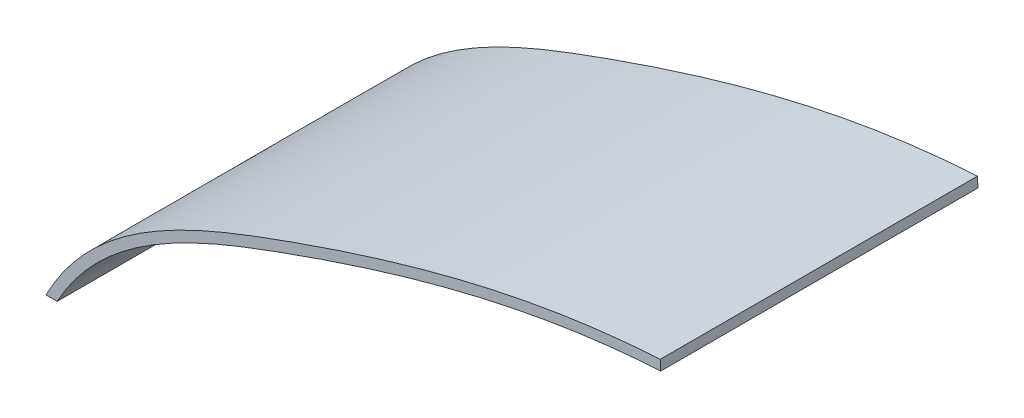
ISO-10303-21;
HEADER;
FILE_DESCRIPTION(('STEP AP214'),'2;1');
FILE_NAME('part.step','',(''),(''),'','','');
FILE_SCHEMA(('AUTOMOTIVE_DESIGN { 1 0 10303 214 1 1 1 1 }'));
ENDSEC;
DATA;
#1=APPLICATION_CONTEXT('core data for automotive mechanical design processes');
#2=APPLICATION_PROTOCOL_DEFINITION('international standard','automotive_design',2000,#1);
#3=PRODUCT_CONTEXT('',#1,'mechanical');
#4=PRODUCT('Part','Part','',(#3));
#5=PRODUCT_RELATED_PRODUCT_CATEGORY('part','',(#4));
#6=PRODUCT_DEFINITION_FORMATION('','',#4);
#7=PRODUCT_DEFINITION_CONTEXT('part definition',#1,'design');
#8=PRODUCT_DEFINITION('design','',#6,#7);
#9=PRODUCT_DEFINITION_SHAPE('','',#8);
#10=(LENGTH_UNIT() NAMED_UNIT(*) SI_UNIT(.MILLI.,.METRE.));
#11=(NAMED_UNIT(*) PLANE_ANGLE_UNIT() SI_UNIT($,.RADIAN.));
#12=(NAMED_UNIT(*) SI_UNIT($,.STERADIAN.) SOLID_ANGLE_UNIT());
#13=UNCERTAINTY_MEASURE_WITH_UNIT(LENGTH_MEASURE(1.E-05),#10,'distance_accuracy_value','');
#14=(GEOMETRIC_REPRESENTATION_CONTEXT(3) GLOBAL_UNCERTAINTY_ASSIGNED_CONTEXT((#13)) GLOBAL_UNIT_ASSIGNED_CONTEXT((#10,
#11,#12)) REPRESENTATION_CONTEXT('',''));
#15=CARTESIAN_POINT('',(0.,0.,0.));
#16=DIRECTION('',(0.,0.,1.));
#17=DIRECTION('',(1.,0.,0.));
#18=AXIS2_PLACEMENT_3D('',#15,#16,#17);
#19=CARTESIAN_POINT('',(0.,70.,160.));
#20=DIRECTION('',(0.,-1.,0.));
#21=DIRECTION('',(1.,0.,0.));
#22=AXIS2_PLACEMENT_3D('',#19,#20,#21);
#23=PLANE('',#22);
#24=DIRECTION('',(-1.,0.,0.));
#25=VECTOR('',#24,1.);
#26=CARTESIAN_POINT('',(0.,70.,0.));
#27=LINE('',#26,#25);
#28=CARTESIAN_POINT('',(-244.343160902711,70.,0.));
#29=VERTEX_POINT('',#28);
#30=CARTESIAN_POINT('',(-250.,70.,0.));
#31=VERTEX_POINT('',#30);
#32=EDGE_CURVE('E104',#29,#31,#27,.T.);
#33=ORIENTED_EDGE('',*,*,#32,.F.);
#34=DIRECTION('',(0.,0.,-1.));
#35=VECTOR('',#34,1.);
#36=CARTESIAN_POINT('',(-244.343160902711,70.,160.));
#37=LINE('',#36,#35);
#38=CARTESIAN_POINT('',(-244.343160902711,70.,160.));
#39=VERTEX_POINT('',#38);
#40=EDGE_CURVE('E11',#39,#29,#37,.T.);
#41=ORIENTED_EDGE('',*,*,#40,.F.);
#42=DIRECTION('',(-1.,0.,0.));
#43=VECTOR('',#42,1.);
#44=CARTESIAN_POINT('',(0.,70.,160.));
#45=LINE('',#44,#43);
#46=CARTESIAN_POINT('',(-250.,70.,160.));
#47=VERTEX_POINT('',#46);
#48=EDGE_CURVE('E83',#39,#47,#45,.T.);
#49=ORIENTED_EDGE('',*,*,#48,.T.);
#50=DIRECTION('',(0.,0.,-1.));
#51=VECTOR('',#50,1.);
#52=CARTESIAN_POINT('',(-250.,70.,160.));
#53=LINE('',#52,#51);
#54=EDGE_CURVE('E51',#47,#31,#53,.T.);
#55=ORIENTED_EDGE('',*,*,#54,.T.);
#56=EDGE_LOOP('',(#33,#41,#49,#55));
#57=FACE_BOUND('',#56,.T.);
#58=ADVANCED_FACE('F35',(#57),#23,.T.);
#59=CARTESIAN_POINT('',(-245.555295044832,67.7098912991945,160.));
#60=CARTESIAN_POINT('',(-244.724782315647,69.3217728843081,160.));
#61=CARTESIAN_POINT('',(-242.978041658524,72.5267977731338,160.));
#62=CARTESIAN_POINT('',(-239.282280538827,78.6161620411629,160.));
#63=CARTESIAN_POINT('',(-234.237004508889,85.7661790801635,160.));
#64=CARTESIAN_POINT('',(-227.565736601114,93.6352532125638,160.));
#65=CARTESIAN_POINT('',(-217.899967362331,103.27309143331,160.));
#66=CARTESIAN_POINT('',(-204.48609280574,113.855071147966,160.));
#67=CARTESIAN_POINT('',(-186.64130776835,124.628463907914,160.));
#68=CARTESIAN_POINT('',(-167.469699238201,133.88137782821,160.));
#69=CARTESIAN_POINT('',(-147.418263216562,142.016984158183,160.));
#70=CARTESIAN_POINT('',(-126.924965170766,149.491485063337,160.));
#71=CARTESIAN_POINT('',(-106.497755999249,156.615857697747,160.));
#72=CARTESIAN_POINT('',(-86.0881001645061,163.272517902471,160.));
#73=CARTESIAN_POINT('',(-58.8409112021339,171.461327008189,160.));
#74=CARTESIAN_POINT('',(-31.4529070049393,178.489029556547,160.));
#75=CARTESIAN_POINT('',(-3.7428429680862,184.11128030425,160.));
#76=CARTESIAN_POINT('',(17.2447323481496,187.563620229931,160.));
#77=CARTESIAN_POINT('',(34.9502714616759,189.752949697112,160.));
#78=CARTESIAN_POINT('',(49.253062668773,191.060254150414,160.));
#79=CARTESIAN_POINT('',(56.4793157997938,191.562160872999,160.));
#80=CARTESIAN_POINT('',(60.0868927742694,191.772418563787,160.));
#81=B_SPLINE_CURVE_WITH_KNOTS('',3,(#59,#60,#61,#62,#63,#64,#65,#66,#67,#68,#69,#70,#71,#72,#73,
#74,#75,#76,#77,#78,#79,#80),.UNSPECIFIED.,.F.,.F.,(4,1,1,1,1,1,1,1,1,1,1,1,1,1,1,1,1,1,1,4),
(0.,0.015625,0.03125,0.0625,0.09375,0.125,0.1875,0.25,0.3125,0.375,0.4375,0.5,0.5625,0.625,0.75,
0.8125,0.875,0.9375,0.96875,1.),.UNSPECIFIED.);
#82=DIRECTION('',(0.,0.,-1.));
#83=VECTOR('',#82,1.);
#84=SURFACE_OF_LINEAR_EXTRUSION('',#81,#83);
#85=CARTESIAN_POINT('',(-245.555295044832,67.7098912991945,0.));
#86=CARTESIAN_POINT('',(-244.724782315647,69.3217728843081,0.));
#87=CARTESIAN_POINT('',(-242.978041658524,72.5267977731338,0.));
#88=CARTESIAN_POINT('',(-239.282280538827,78.6161620411629,0.));
#89=CARTESIAN_POINT('',(-234.237004508889,85.7661790801635,0.));
#90=CARTESIAN_POINT('',(-227.565736601114,93.6352532125638,0.));
#91=CARTESIAN_POINT('',(-217.899967362331,103.27309143331,0.));
#92=CARTESIAN_POINT('',(-204.48609280574,113.855071147966,0.));
#93=CARTESIAN_POINT('',(-186.64130776835,124.628463907914,0.));
#94=CARTESIAN_POINT('',(-167.469699238201,133.88137782821,0.));
#95=CARTESIAN_POINT('',(-147.418263216562,142.016984158183,0.));
#96=CARTESIAN_POINT('',(-126.924965170766,149.491485063337,0.));
#97=CARTESIAN_POINT('',(-106.497755999249,156.615857697747,0.));
#98=CARTESIAN_POINT('',(-86.0881001645061,163.272517902471,0.));
#99=CARTESIAN_POINT('',(-58.8409112021339,171.461327008189,0.));
#100=CARTESIAN_POINT('',(-31.4529070049393,178.489029556547,0.));
#101=CARTESIAN_POINT('',(-3.7428429680862,184.11128030425,0.));
#102=CARTESIAN_POINT('',(17.2447323481496,187.563620229931,0.));
#103=CARTESIAN_POINT('',(34.9502714616759,189.752949697112,0.));
#104=CARTESIAN_POINT('',(49.253062668773,191.060254150414,0.));
#105=CARTESIAN_POINT('',(56.4793157997938,191.562160872999,0.));
#106=CARTESIAN_POINT('',(60.0868927742694,191.772418563787,0.));
#107=B_SPLINE_CURVE_WITH_KNOTS('',3,(#85,#86,#87,#88,#89,#90,#91,#92,#93,#94,#95,#96,#97,#98,
#99,#100,#101,#102,#103,#104,#105,#106),.UNSPECIFIED.,.F.,.F.,(4,1,1,1,1,1,1,1,1,1,1,1,1,1,1,1,
1,1,1,4),(0.,0.015625,0.03125,0.0625,0.09375,0.125,0.1875,0.25,0.3125,0.375,0.4375,0.5,0.5625,
0.625,0.75,0.8125,0.875,0.9375,0.96875,1.),.UNSPECIFIED.);
#108=CARTESIAN_POINT('',(60.0868927742694,191.772418563787,0.));
#109=VERTEX_POINT('',#108);
#110=EDGE_CURVE('E89',#29,#109,#107,.T.);
#111=ORIENTED_EDGE('',*,*,#110,.T.);
#112=DIRECTION('',(0.,0.,-1.));
#113=VECTOR('',#112,1.);
#114=CARTESIAN_POINT('',(60.0868927742694,191.772418563787,160.));
#115=LINE('',#114,#113);
#116=CARTESIAN_POINT('',(60.0868927742694,191.772418563787,160.));
#117=VERTEX_POINT('',#116);
#118=EDGE_CURVE('E43',#117,#109,#115,.T.);
#119=ORIENTED_EDGE('',*,*,#118,.F.);
#120=EDGE_CURVE('E77',#39,#117,#81,.T.);
#121=ORIENTED_EDGE('',*,*,#120,.F.);
#122=ORIENTED_EDGE('',*,*,#40,.T.);
#123=EDGE_LOOP('',(#111,#119,#121,#122));
#124=FACE_BOUND('',#123,.T.);
#125=ADVANCED_FACE('F87',(#124),#84,.F.);
#126=CARTESIAN_POINT('',(71.022569257918,4.13935489435081,160.));
#127=DIRECTION('',(0.998305904550392,0.0581835108929023,0.));
#128=DIRECTION('',(-0.0581835108929023,0.998305904550392,0.));
#129=AXIS2_PLACEMENT_3D('',#126,#127,#128);
#130=PLANE('',#129);
#131=DIRECTION('',(0.0581835108929023,-0.998305904550392,0.));
#132=VECTOR('',#131,1.);
#133=CARTESIAN_POINT('',(71.022569257918,4.13935489435081,0.));
#134=LINE('',#133,#132);
#135=CARTESIAN_POINT('',(59.7959752198049,196.763948086539,0.));
#136=VERTEX_POINT('',#135);
#137=EDGE_CURVE('E125',#136,#109,#134,.T.);
#138=ORIENTED_EDGE('',*,*,#137,.F.);
#139=DIRECTION('',(0.,0.,-1.));
#140=VECTOR('',#139,1.);
#141=CARTESIAN_POINT('',(59.7959752198049,196.763948086539,160.));
#142=LINE('',#141,#140);
#143=CARTESIAN_POINT('',(59.7959752198049,196.763948086539,160.));
#144=VERTEX_POINT('',#143);
#145=EDGE_CURVE('E64',#144,#136,#142,.T.);
#146=ORIENTED_EDGE('',*,*,#145,.F.);
#147=DIRECTION('',(0.0581835108929023,-0.998305904550392,0.));
#148=VECTOR('',#147,1.);
#149=CARTESIAN_POINT('',(71.022569257918,4.13935489435081,160.));
#150=LINE('',#149,#148);
#151=EDGE_CURVE('E82',#144,#117,#150,.T.);
#152=ORIENTED_EDGE('',*,*,#151,.T.);
#153=ORIENTED_EDGE('',*,*,#118,.T.);
#154=EDGE_LOOP('',(#138,#146,#152,#153));
#155=FACE_BOUND('',#154,.T.);
#156=ADVANCED_FACE('F92',(#155),#130,.T.);
#157=CARTESIAN_POINT('',(-250.,70.,160.));
#158=CARTESIAN_POINT('',(-226.206936908058,116.178220879291,160.));
#159=CARTESIAN_POINT('',(-115.667050097993,162.548737670475,160.));
#160=CARTESIAN_POINT('',(-7.40584295926592,192.847275148693,160.));
#161=CARTESIAN_POINT('',(59.7959752198048,196.763948086539,160.));
#162=B_SPLINE_CURVE_WITH_KNOTS('',3,(#157,#158,#159,#160,#161),.UNSPECIFIED.,.F.,.F.,(4,1,4),
(0.,0.425611974187107,1.),.UNSPECIFIED.);
#163=DIRECTION('',(0.,0.,-1.));
#164=VECTOR('',#163,1.);
#165=SURFACE_OF_LINEAR_EXTRUSION('',#162,#164);
#166=CARTESIAN_POINT('',(-250.,70.,0.));
#167=CARTESIAN_POINT('',(-226.206936908058,116.178220879291,0.));
#168=CARTESIAN_POINT('',(-115.667050097993,162.548737670475,0.));
#169=CARTESIAN_POINT('',(-7.40584295926592,192.847275148693,0.));
#170=CARTESIAN_POINT('',(59.7959752198048,196.763948086539,0.));
#171=B_SPLINE_CURVE_WITH_KNOTS('',3,(#166,#167,#168,#169,#170),.UNSPECIFIED.,.F.,.F.,(4,1,4),
(0.,0.425611974187107,1.),.UNSPECIFIED.);
#172=EDGE_CURVE('E126',#31,#136,#171,.T.);
#173=ORIENTED_EDGE('',*,*,#172,.F.);
#174=ORIENTED_EDGE('',*,*,#54,.F.);
#175=EDGE_CURVE('E93',#47,#144,#162,.T.);
#176=ORIENTED_EDGE('',*,*,#175,.T.);
#177=ORIENTED_EDGE('',*,*,#145,.T.);
#178=EDGE_LOOP('',(#173,#174,#176,#177));
#179=FACE_BOUND('',#178,.T.);
#180=ADVANCED_FACE('F110',(#179),#165,.T.);
#181=CARTESIAN_POINT('',(0.,0.,160.));
#182=DIRECTION('',(0.,0.,1.));
#183=DIRECTION('',(1.,0.,0.));
#184=AXIS2_PLACEMENT_3D('',#181,#182,#183);
#185=PLANE('',#184);
#186=ORIENTED_EDGE('',*,*,#48,.F.);
#187=ORIENTED_EDGE('',*,*,#120,.T.);
#188=ORIENTED_EDGE('',*,*,#151,.F.);
#189=ORIENTED_EDGE('',*,*,#175,.F.);
#190=EDGE_LOOP('',(#186,#187,#188,#189));
#191=FACE_BOUND('',#190,.T.);
#192=ADVANCED_FACE('F79',(#191),#185,.T.);
#193=CARTESIAN_POINT('',(0.,0.,0.));
#194=DIRECTION('',(0.,0.,1.));
#195=DIRECTION('',(1.,0.,0.));
#196=AXIS2_PLACEMENT_3D('',#193,#194,#195);
#197=PLANE('',#196);
#198=ORIENTED_EDGE('',*,*,#32,.T.);
#199=ORIENTED_EDGE('',*,*,#172,.T.);
#200=ORIENTED_EDGE('',*,*,#137,.T.);
#201=ORIENTED_EDGE('',*,*,#110,.F.);
#202=EDGE_LOOP('',(#198,#199,#200,#201));
#203=FACE_BOUND('',#202,.T.);
#204=ADVANCED_FACE('F114',(#203),#197,.F.);
#205=CLOSED_SHELL('',(#58,#125,#156,#180,#192,#204));
#206=MANIFOLD_SOLID_BREP('B2',#205);
#207=ADVANCED_BREP_SHAPE_REPRESENTATION('',(#18,#206),#14);
#208=SHAPE_DEFINITION_REPRESENTATION(#9,#207);
ENDSEC;
END-ISO-10303-21;
